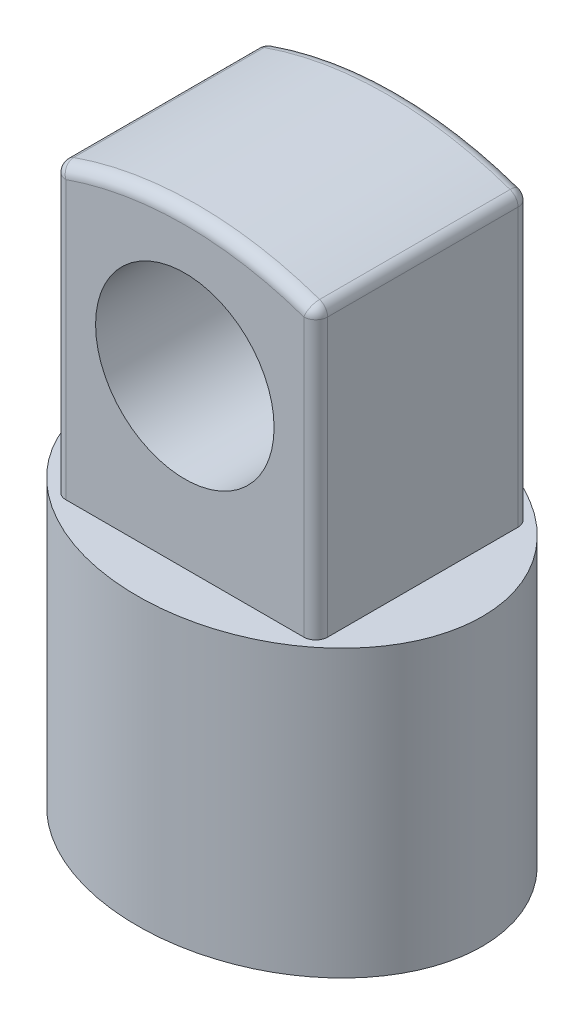
ISO-10303-21;
HEADER;
FILE_DESCRIPTION(('STEP AP214'),'2;1');
FILE_NAME('part.step','',(''),(''),'','','');
FILE_SCHEMA(('AUTOMOTIVE_DESIGN { 1 0 10303 214 1 1 1 1 }'));
ENDSEC;
DATA;
#1=APPLICATION_CONTEXT('core data for automotive mechanical design processes');
#2=APPLICATION_PROTOCOL_DEFINITION('international standard','automotive_design',2000,#1);
#3=PRODUCT_CONTEXT('',#1,'mechanical');
#4=PRODUCT('Part','Part','',(#3));
#5=PRODUCT_RELATED_PRODUCT_CATEGORY('part','',(#4));
#6=PRODUCT_DEFINITION_FORMATION('','',#4);
#7=PRODUCT_DEFINITION_CONTEXT('part definition',#1,'design');
#8=PRODUCT_DEFINITION('design','',#6,#7);
#9=PRODUCT_DEFINITION_SHAPE('','',#8);
#10=(LENGTH_UNIT() NAMED_UNIT(*) SI_UNIT(.MILLI.,.METRE.));
#11=(NAMED_UNIT(*) PLANE_ANGLE_UNIT() SI_UNIT($,.RADIAN.));
#12=(NAMED_UNIT(*) SI_UNIT($,.STERADIAN.) SOLID_ANGLE_UNIT());
#13=UNCERTAINTY_MEASURE_WITH_UNIT(LENGTH_MEASURE(1.E-05),#10,'distance_accuracy_value','');
#14=(GEOMETRIC_REPRESENTATION_CONTEXT(3) GLOBAL_UNCERTAINTY_ASSIGNED_CONTEXT((#13)) GLOBAL_UNIT_ASSIGNED_CONTEXT((#10,
#11,#12)) REPRESENTATION_CONTEXT('',''));
#15=CARTESIAN_POINT('',(0.,0.,0.));
#16=DIRECTION('',(0.,0.,1.));
#17=DIRECTION('',(1.,0.,0.));
#18=AXIS2_PLACEMENT_3D('',#15,#16,#17);
#19=CARTESIAN_POINT('',(0.,0.,0.));
#20=DIRECTION('',(0.,1.,0.));
#21=DIRECTION('',(1.,0.,0.));
#22=AXIS2_PLACEMENT_3D('',#19,#20,#21);
#23=ELLIPSE('',#22,8.,6.5);
#24=DIRECTION('',(0.,1.,0.));
#25=VECTOR('',#24,1.);
#26=SURFACE_OF_LINEAR_EXTRUSION('',#23,#25);
#27=CARTESIAN_POINT('',(8.,0.,0.));
#28=VERTEX_POINT('',#27);
#29=EDGE_CURVE('E225',#28,#28,#23,.T.);
#30=ORIENTED_EDGE('',*,*,#29,.T.);
#31=EDGE_LOOP('',(#30));
#32=FACE_BOUND('',#31,.T.);
#33=CARTESIAN_POINT('',(0.,12.,0.));
#34=DIRECTION('',(0.,1.,0.));
#35=DIRECTION('',(1.,0.,0.));
#36=AXIS2_PLACEMENT_3D('',#33,#34,#35);
#37=ELLIPSE('',#36,8.,6.5);
#38=CARTESIAN_POINT('',(8.,12.,0.));
#39=VERTEX_POINT('',#38);
#40=EDGE_CURVE('E221',#39,#39,#37,.T.);
#41=ORIENTED_EDGE('',*,*,#40,.F.);
#42=EDGE_LOOP('',(#41));
#43=FACE_BOUND('',#42,.T.);
#44=ADVANCED_FACE('F41',(#32,#43),#26,.T.);
#45=CARTESIAN_POINT('',(0.,0.,0.));
#46=DIRECTION('',(0.,1.,0.));
#47=DIRECTION('',(0.,0.,1.));
#48=AXIS2_PLACEMENT_3D('',#45,#46,#47);
#49=PLANE('',#48);
#50=ORIENTED_EDGE('',*,*,#29,.F.);
#51=EDGE_LOOP('',(#50));
#52=FACE_BOUND('',#51,.T.);
#53=ADVANCED_FACE('F235',(#52),#49,.F.);
#54=CARTESIAN_POINT('',(0.,12.,0.));
#55=DIRECTION('',(0.,1.,0.));
#56=DIRECTION('',(0.,0.,1.));
#57=AXIS2_PLACEMENT_3D('',#54,#55,#56);
#58=PLANE('',#57);
#59=DIRECTION('',(1.,0.,0.));
#60=VECTOR('',#59,1.);
#61=CARTESIAN_POINT('',(-5.5,12.,4.5));
#62=LINE('',#61,#60);
#63=CARTESIAN_POINT('',(-5.,12.,4.5));
#64=VERTEX_POINT('',#63);
#65=CARTESIAN_POINT('',(5.,12.,4.5));
#66=VERTEX_POINT('',#65);
#67=EDGE_CURVE('E121',#64,#66,#62,.T.);
#68=ORIENTED_EDGE('',*,*,#67,.F.);
#69=CARTESIAN_POINT('',(-5.,12.,4.));
#70=DIRECTION('',(0.,1.,0.));
#71=DIRECTION('',(0.,0.,1.));
#72=AXIS2_PLACEMENT_3D('',#69,#70,#71);
#73=CIRCLE('',#72,0.5);
#74=CARTESIAN_POINT('',(-5.5,12.,4.));
#75=VERTEX_POINT('',#74);
#76=EDGE_CURVE('E11',#64,#75,#73,.F.);
#77=ORIENTED_EDGE('',*,*,#76,.T.);
#78=DIRECTION('',(0.,0.,1.));
#79=VECTOR('',#78,1.);
#80=CARTESIAN_POINT('',(-5.5,12.,-4.5));
#81=LINE('',#80,#79);
#82=CARTESIAN_POINT('',(-5.5,12.,-4.));
#83=VERTEX_POINT('',#82);
#84=EDGE_CURVE('E216',#83,#75,#81,.T.);
#85=ORIENTED_EDGE('',*,*,#84,.F.);
#86=CARTESIAN_POINT('',(-5.,12.,-4.));
#87=DIRECTION('',(0.,1.,0.));
#88=DIRECTION('',(0.,0.,1.));
#89=AXIS2_PLACEMENT_3D('',#86,#87,#88);
#90=CIRCLE('',#89,0.5);
#91=CARTESIAN_POINT('',(-5.,12.,-4.5));
#92=VERTEX_POINT('',#91);
#93=EDGE_CURVE('E50',#83,#92,#90,.F.);
#94=ORIENTED_EDGE('',*,*,#93,.T.);
#95=DIRECTION('',(1.,0.,0.));
#96=VECTOR('',#95,1.);
#97=CARTESIAN_POINT('',(-5.5,12.,-4.5));
#98=LINE('',#97,#96);
#99=CARTESIAN_POINT('',(5.,12.,-4.5));
#100=VERTEX_POINT('',#99);
#101=EDGE_CURVE('E130',#92,#100,#98,.T.);
#102=ORIENTED_EDGE('',*,*,#101,.T.);
#103=CARTESIAN_POINT('',(5.,12.,-4.));
#104=DIRECTION('',(0.,1.,0.));
#105=DIRECTION('',(0.,0.,1.));
#106=AXIS2_PLACEMENT_3D('',#103,#104,#105);
#107=CIRCLE('',#106,0.5);
#108=CARTESIAN_POINT('',(5.5,12.,-4.));
#109=VERTEX_POINT('',#108);
#110=EDGE_CURVE('E177',#100,#109,#107,.F.);
#111=ORIENTED_EDGE('',*,*,#110,.T.);
#112=DIRECTION('',(0.,0.,1.));
#113=VECTOR('',#112,1.);
#114=CARTESIAN_POINT('',(5.5,12.,-4.5));
#115=LINE('',#114,#113);
#116=CARTESIAN_POINT('',(5.5,12.,4.));
#117=VERTEX_POINT('',#116);
#118=EDGE_CURVE('E138',#109,#117,#115,.T.);
#119=ORIENTED_EDGE('',*,*,#118,.T.);
#120=CARTESIAN_POINT('',(5.,12.,4.));
#121=DIRECTION('',(0.,1.,0.));
#122=DIRECTION('',(0.,0.,1.));
#123=AXIS2_PLACEMENT_3D('',#120,#121,#122);
#124=CIRCLE('',#123,0.5);
#125=EDGE_CURVE('E134',#117,#66,#124,.F.);
#126=ORIENTED_EDGE('',*,*,#125,.T.);
#127=EDGE_LOOP('',(#68,#77,#85,#94,#102,#111,#119,#126));
#128=FACE_BOUND('',#127,.T.);
#129=ORIENTED_EDGE('',*,*,#40,.T.);
#130=EDGE_LOOP('',(#129));
#131=FACE_BOUND('',#130,.T.);
#132=ADVANCED_FACE('F135',(#128,#131),#58,.T.);
#133=CARTESIAN_POINT('',(0.,9.375,-4.5));
#134=DIRECTION('',(0.,0.,1.));
#135=DIRECTION('',(1.,0.,0.));
#136=AXIS2_PLACEMENT_3D('',#133,#134,#135);
#137=CYLINDRICAL_SURFACE('',#136,15.625);
#138=CARTESIAN_POINT('',(0.,9.375,-4.));
#139=DIRECTION('',(0.,0.,1.));
#140=DIRECTION('',(1.,0.,0.));
#141=AXIS2_PLACEMENT_3D('',#138,#139,#140);
#142=CIRCLE('',#141,15.625);
#143=CARTESIAN_POINT('',(5.16528925619835,24.1215389803778,-4.));
#144=VERTEX_POINT('',#143);
#145=CARTESIAN_POINT('',(-5.16528925619835,24.1215389803778,-4.));
#146=VERTEX_POINT('',#145);
#147=EDGE_CURVE('E175',#144,#146,#142,.T.);
#148=ORIENTED_EDGE('',*,*,#147,.T.);
#149=DIRECTION('',(0.,0.,1.));
#150=VECTOR('',#149,1.);
#151=CARTESIAN_POINT('',(-5.16528925619835,24.1215389803778,-4.5));
#152=LINE('',#151,#150);
#153=CARTESIAN_POINT('',(-5.16528925619835,24.1215389803778,4.));
#154=VERTEX_POINT('',#153);
#155=EDGE_CURVE('E58',#146,#154,#152,.T.);
#156=ORIENTED_EDGE('',*,*,#155,.T.);
#157=CARTESIAN_POINT('',(0.,9.375,4.));
#158=DIRECTION('',(0.,0.,1.));
#159=DIRECTION('',(1.,0.,0.));
#160=AXIS2_PLACEMENT_3D('',#157,#158,#159);
#161=CIRCLE('',#160,15.625);
#162=CARTESIAN_POINT('',(5.16528925619835,24.1215389803778,4.));
#163=VERTEX_POINT('',#162);
#164=EDGE_CURVE('E143',#154,#163,#161,.F.);
#165=ORIENTED_EDGE('',*,*,#164,.T.);
#166=DIRECTION('',(0.,0.,1.));
#167=VECTOR('',#166,1.);
#168=CARTESIAN_POINT('',(5.16528925619835,24.1215389803778,-4.5));
#169=LINE('',#168,#167);
#170=EDGE_CURVE('E154',#163,#144,#169,.F.);
#171=ORIENTED_EDGE('',*,*,#170,.T.);
#172=EDGE_LOOP('',(#148,#156,#165,#171));
#173=FACE_BOUND('',#172,.T.);
#174=ADVANCED_FACE('F326',(#173),#137,.T.);
#175=CARTESIAN_POINT('',(5.5,12.,-4.5));
#176=DIRECTION('',(1.,0.,0.));
#177=DIRECTION('',(0.,0.,-1.));
#178=AXIS2_PLACEMENT_3D('',#175,#176,#177);
#179=PLANE('',#178);
#180=ORIENTED_EDGE('',*,*,#118,.F.);
#181=DIRECTION('',(0.,1.,0.));
#182=VECTOR('',#181,1.);
#183=CARTESIAN_POINT('',(5.5,23.6496497330057,-4.));
#184=LINE('',#183,#182);
#185=CARTESIAN_POINT('',(5.5,23.6496497330057,-4.));
#186=VERTEX_POINT('',#185);
#187=EDGE_CURVE('E142',#109,#186,#184,.T.);
#188=ORIENTED_EDGE('',*,*,#187,.T.);
#189=DIRECTION('',(0.,0.,1.));
#190=VECTOR('',#189,1.);
#191=CARTESIAN_POINT('',(5.5,23.6496497330057,-4.5));
#192=LINE('',#191,#190);
#193=CARTESIAN_POINT('',(5.5,23.6496497330057,4.));
#194=VERTEX_POINT('',#193);
#195=EDGE_CURVE('E229',#186,#194,#192,.T.);
#196=ORIENTED_EDGE('',*,*,#195,.T.);
#197=DIRECTION('',(0.,1.,0.));
#198=VECTOR('',#197,1.);
#199=CARTESIAN_POINT('',(5.5,12.,4.));
#200=LINE('',#199,#198);
#201=EDGE_CURVE('E149',#194,#117,#200,.F.);
#202=ORIENTED_EDGE('',*,*,#201,.T.);
#203=EDGE_LOOP('',(#180,#188,#196,#202));
#204=FACE_BOUND('',#203,.T.);
#205=ADVANCED_FACE('F320',(#204),#179,.T.);
#206=CARTESIAN_POINT('',(-5.5,24.,-4.5));
#207=DIRECTION('',(-1.,0.,0.));
#208=DIRECTION('',(0.,0.,1.));
#209=AXIS2_PLACEMENT_3D('',#206,#207,#208);
#210=PLANE('',#209);
#211=DIRECTION('',(0.,0.,1.));
#212=VECTOR('',#211,1.);
#213=CARTESIAN_POINT('',(-5.5,23.6496497330057,-4.5));
#214=LINE('',#213,#212);
#215=CARTESIAN_POINT('',(-5.5,23.6496497330057,4.));
#216=VERTEX_POINT('',#215);
#217=CARTESIAN_POINT('',(-5.5,23.6496497330057,-4.));
#218=VERTEX_POINT('',#217);
#219=EDGE_CURVE('E179',#216,#218,#214,.F.);
#220=ORIENTED_EDGE('',*,*,#219,.T.);
#221=DIRECTION('',(0.,-1.,0.));
#222=VECTOR('',#221,1.);
#223=CARTESIAN_POINT('',(-5.5,12.,-4.));
#224=LINE('',#223,#222);
#225=EDGE_CURVE('E187',#218,#83,#224,.T.);
#226=ORIENTED_EDGE('',*,*,#225,.T.);
#227=ORIENTED_EDGE('',*,*,#84,.T.);
#228=DIRECTION('',(0.,-1.,0.));
#229=VECTOR('',#228,1.);
#230=CARTESIAN_POINT('',(-5.5,24.,4.));
#231=LINE('',#230,#229);
#232=EDGE_CURVE('E185',#75,#216,#231,.F.);
#233=ORIENTED_EDGE('',*,*,#232,.T.);
#234=EDGE_LOOP('',(#220,#226,#227,#233));
#235=FACE_BOUND('',#234,.T.);
#236=ADVANCED_FACE('F218',(#235),#210,.T.);
#237=CARTESIAN_POINT('',(0.,9.375,-4.5));
#238=DIRECTION('',(0.,0.,1.));
#239=DIRECTION('',(1.,0.,0.));
#240=AXIS2_PLACEMENT_3D('',#237,#238,#239);
#241=PLANE('',#240);
#242=CARTESIAN_POINT('',(0.,19.,-4.5));
#243=DIRECTION('',(0.,0.,-1.));
#244=DIRECTION('',(-1.,0.,0.));
#245=AXIS2_PLACEMENT_3D('',#242,#243,#244);
#246=CIRCLE('',#245,3.74999999999999);
#247=CARTESIAN_POINT('',(-3.74999999999999,19.,-4.5));
#248=VERTEX_POINT('',#247);
#249=EDGE_CURVE('E165',#248,#248,#246,.T.);
#250=ORIENTED_EDGE('',*,*,#249,.F.);
#251=EDGE_LOOP('',(#250));
#252=FACE_BOUND('',#251,.T.);
#253=ORIENTED_EDGE('',*,*,#101,.F.);
#254=DIRECTION('',(0.,-1.,0.));
#255=VECTOR('',#254,1.);
#256=CARTESIAN_POINT('',(-5.,23.4645573031944,-4.5));
#257=LINE('',#256,#255);
#258=CARTESIAN_POINT('',(-5.,23.6496497330057,-4.5));
#259=VERTEX_POINT('',#258);
#260=EDGE_CURVE('E190',#92,#259,#257,.F.);
#261=ORIENTED_EDGE('',*,*,#260,.T.);
#262=CARTESIAN_POINT('',(0.,9.375,-4.5));
#263=DIRECTION('',(0.,0.,1.));
#264=DIRECTION('',(1.,0.,0.));
#265=AXIS2_PLACEMENT_3D('',#262,#263,#264);
#266=CIRCLE('',#265,15.125);
#267=CARTESIAN_POINT('',(5.,23.6496497330057,-4.5));
#268=VERTEX_POINT('',#267);
#269=EDGE_CURVE('E168',#259,#268,#266,.F.);
#270=ORIENTED_EDGE('',*,*,#269,.T.);
#271=DIRECTION('',(0.,1.,0.));
#272=VECTOR('',#271,1.);
#273=CARTESIAN_POINT('',(5.,12.,-4.5));
#274=LINE('',#273,#272);
#275=EDGE_CURVE('E170',#268,#100,#274,.F.);
#276=ORIENTED_EDGE('',*,*,#275,.T.);
#277=EDGE_LOOP('',(#253,#261,#270,#276));
#278=FACE_BOUND('',#277,.T.);
#279=ADVANCED_FACE('F302',(#252,#278),#241,.F.);
#280=CARTESIAN_POINT('',(0.,9.375,4.5));
#281=DIRECTION('',(0.,0.,1.));
#282=DIRECTION('',(1.,0.,0.));
#283=AXIS2_PLACEMENT_3D('',#280,#281,#282);
#284=PLANE('',#283);
#285=CARTESIAN_POINT('',(0.,19.,4.5));
#286=DIRECTION('',(0.,0.,1.));
#287=DIRECTION('',(1.,0.,0.));
#288=AXIS2_PLACEMENT_3D('',#285,#286,#287);
#289=CIRCLE('',#288,3.74999999999999);
#290=CARTESIAN_POINT('',(3.74999999999998,19.,4.5));
#291=VERTEX_POINT('',#290);
#292=EDGE_CURVE('E131',#291,#291,#289,.T.);
#293=ORIENTED_EDGE('',*,*,#292,.F.);
#294=EDGE_LOOP('',(#293));
#295=FACE_BOUND('',#294,.T.);
#296=CARTESIAN_POINT('',(0.,9.375,4.5));
#297=DIRECTION('',(0.,0.,1.));
#298=DIRECTION('',(1.,0.,0.));
#299=AXIS2_PLACEMENT_3D('',#296,#297,#298);
#300=CIRCLE('',#299,15.125);
#301=CARTESIAN_POINT('',(5.,23.6496497330057,4.5));
#302=VERTEX_POINT('',#301);
#303=CARTESIAN_POINT('',(-5.,23.6496497330057,4.5));
#304=VERTEX_POINT('',#303);
#305=EDGE_CURVE('E150',#302,#304,#300,.T.);
#306=ORIENTED_EDGE('',*,*,#305,.T.);
#307=DIRECTION('',(0.,-1.,0.));
#308=VECTOR('',#307,1.);
#309=CARTESIAN_POINT('',(-5.,9.375,4.5));
#310=LINE('',#309,#308);
#311=EDGE_CURVE('E127',#304,#64,#310,.T.);
#312=ORIENTED_EDGE('',*,*,#311,.T.);
#313=ORIENTED_EDGE('',*,*,#67,.T.);
#314=DIRECTION('',(0.,1.,0.));
#315=VECTOR('',#314,1.);
#316=CARTESIAN_POINT('',(5.,9.375,4.5));
#317=LINE('',#316,#315);
#318=EDGE_CURVE('E125',#66,#302,#317,.T.);
#319=ORIENTED_EDGE('',*,*,#318,.T.);
#320=EDGE_LOOP('',(#306,#312,#313,#319));
#321=FACE_BOUND('',#320,.T.);
#322=ADVANCED_FACE('F123',(#295,#321),#284,.T.);
#323=CARTESIAN_POINT('',(0.,19.,-4.5));
#324=DIRECTION('',(0.,0.,-1.));
#325=DIRECTION('',(-1.,0.,0.));
#326=AXIS2_PLACEMENT_3D('',#323,#324,#325);
#327=CYLINDRICAL_SURFACE('',#326,3.74999999999999);
#328=ORIENTED_EDGE('',*,*,#292,.T.);
#329=EDGE_LOOP('',(#328));
#330=FACE_BOUND('',#329,.T.);
#331=ORIENTED_EDGE('',*,*,#249,.T.);
#332=EDGE_LOOP('',(#331));
#333=FACE_BOUND('',#332,.T.);
#334=ADVANCED_FACE('F242',(#330,#333),#327,.F.);
#335=CARTESIAN_POINT('',(5.,23.6496497330057,-4.5));
#336=DIRECTION('',(0.,0.,1.));
#337=DIRECTION('',(1.,0.,0.));
#338=AXIS2_PLACEMENT_3D('',#335,#336,#337);
#339=CYLINDRICAL_SURFACE('',#338,0.5);
#340=ORIENTED_EDGE('',*,*,#195,.F.);
#341=CARTESIAN_POINT('',(5.,23.6496497330057,-4.));
#342=DIRECTION('',(0.,0.,1.));
#343=DIRECTION('',(1.,0.,0.));
#344=AXIS2_PLACEMENT_3D('',#341,#342,#343);
#345=CIRCLE('',#344,0.5);
#346=EDGE_CURVE('E173',#186,#144,#345,.T.);
#347=ORIENTED_EDGE('',*,*,#346,.T.);
#348=ORIENTED_EDGE('',*,*,#170,.F.);
#349=CARTESIAN_POINT('',(5.,23.6496497330057,4.));
#350=DIRECTION('',(0.,0.,1.));
#351=DIRECTION('',(1.,0.,0.));
#352=AXIS2_PLACEMENT_3D('',#349,#350,#351);
#353=CIRCLE('',#352,0.5);
#354=EDGE_CURVE('E152',#163,#194,#353,.F.);
#355=ORIENTED_EDGE('',*,*,#354,.T.);
#356=EDGE_LOOP('',(#340,#347,#348,#355));
#357=FACE_BOUND('',#356,.T.);
#358=ADVANCED_FACE('F238',(#357),#339,.T.);
#359=CARTESIAN_POINT('',(0.,9.375,4.));
#360=DIRECTION('',(0.,0.,1.));
#361=DIRECTION('',(1.,0.,0.));
#362=AXIS2_PLACEMENT_3D('',#359,#360,#361);
#363=TOROIDAL_SURFACE('',#362,15.125,0.5);
#364=ORIENTED_EDGE('',*,*,#164,.F.);
#365=CARTESIAN_POINT('',(-5.,23.6496497330057,4.));
#366=DIRECTION('',(-0.943778494744179,-0.330578512396694,0.));
#367=DIRECTION('',(0.330578512396694,-0.943778494744179,0.));
#368=AXIS2_PLACEMENT_3D('',#365,#366,#367);
#369=CIRCLE('',#368,0.5);
#370=EDGE_CURVE('E65',#154,#304,#369,.F.);
#371=ORIENTED_EDGE('',*,*,#370,.T.);
#372=ORIENTED_EDGE('',*,*,#305,.F.);
#373=CARTESIAN_POINT('',(5.,23.6496497330057,4.));
#374=DIRECTION('',(0.94377849474418,-0.330578512396693,0.));
#375=DIRECTION('',(0.330578512396693,0.94377849474418,0.));
#376=AXIS2_PLACEMENT_3D('',#373,#374,#375);
#377=CIRCLE('',#376,0.5);
#378=EDGE_CURVE('E162',#163,#302,#377,.T.);
#379=ORIENTED_EDGE('',*,*,#378,.F.);
#380=EDGE_LOOP('',(#364,#371,#372,#379));
#381=FACE_BOUND('',#380,.T.);
#382=ADVANCED_FACE('F241',(#381),#363,.T.);
#383=CARTESIAN_POINT('',(5.,23.6496497330057,4.));
#384=DIRECTION('',(0.,0.,1.));
#385=DIRECTION('',(1.,0.,0.));
#386=AXIS2_PLACEMENT_3D('',#383,#384,#385);
#387=SPHERICAL_SURFACE('',#386,0.5);
#388=ORIENTED_EDGE('',*,*,#354,.F.);
#389=ORIENTED_EDGE('',*,*,#378,.T.);
#390=CARTESIAN_POINT('',(5.,23.6496497330057,4.));
#391=DIRECTION('',(0.,-1.,0.));
#392=DIRECTION('',(0.,0.,-1.));
#393=AXIS2_PLACEMENT_3D('',#390,#391,#392);
#394=CIRCLE('',#393,0.5);
#395=EDGE_CURVE('E147',#194,#302,#394,.T.);
#396=ORIENTED_EDGE('',*,*,#395,.F.);
#397=EDGE_LOOP('',(#388,#389,#396));
#398=FACE_BOUND('',#397,.T.);
#399=ADVANCED_FACE('F247',(#398),#387,.T.);
#400=CARTESIAN_POINT('',(5.,9.375,4.));
#401=DIRECTION('',(0.,1.,0.));
#402=DIRECTION('',(0.,0.,1.));
#403=AXIS2_PLACEMENT_3D('',#400,#401,#402);
#404=CYLINDRICAL_SURFACE('',#403,0.5);
#405=ORIENTED_EDGE('',*,*,#125,.F.);
#406=ORIENTED_EDGE('',*,*,#201,.F.);
#407=ORIENTED_EDGE('',*,*,#395,.T.);
#408=ORIENTED_EDGE('',*,*,#318,.F.);
#409=EDGE_LOOP('',(#405,#406,#407,#408));
#410=FACE_BOUND('',#409,.T.);
#411=ADVANCED_FACE('F145',(#410),#404,.T.);
#412=CARTESIAN_POINT('',(0.,9.375,-4.));
#413=DIRECTION('',(0.,0.,1.));
#414=DIRECTION('',(1.,0.,0.));
#415=AXIS2_PLACEMENT_3D('',#412,#413,#414);
#416=TOROIDAL_SURFACE('',#415,15.125,0.5);
#417=ORIENTED_EDGE('',*,*,#269,.F.);
#418=CARTESIAN_POINT('',(-5.,23.6496497330057,-4.));
#419=DIRECTION('',(-0.943778494744179,-0.330578512396694,0.));
#420=DIRECTION('',(0.330578512396694,-0.943778494744179,0.));
#421=AXIS2_PLACEMENT_3D('',#418,#419,#420);
#422=CIRCLE('',#421,0.5);
#423=EDGE_CURVE('E192',#259,#146,#422,.F.);
#424=ORIENTED_EDGE('',*,*,#423,.T.);
#425=ORIENTED_EDGE('',*,*,#147,.F.);
#426=CARTESIAN_POINT('',(5.,23.6496497330057,-4.));
#427=DIRECTION('',(0.943778494744179,-0.330578512396693,0.));
#428=DIRECTION('',(0.330578512396693,0.94377849474418,0.));
#429=AXIS2_PLACEMENT_3D('',#426,#427,#428);
#430=CIRCLE('',#429,0.5);
#431=EDGE_CURVE('E163',#268,#144,#430,.T.);
#432=ORIENTED_EDGE('',*,*,#431,.F.);
#433=EDGE_LOOP('',(#417,#424,#425,#432));
#434=FACE_BOUND('',#433,.T.);
#435=ADVANCED_FACE('F246',(#434),#416,.T.);
#436=CARTESIAN_POINT('',(5.,23.6496497330057,-4.));
#437=DIRECTION('',(0.,0.,1.));
#438=DIRECTION('',(1.,0.,0.));
#439=AXIS2_PLACEMENT_3D('',#436,#437,#438);
#440=SPHERICAL_SURFACE('',#439,0.5);
#441=ORIENTED_EDGE('',*,*,#431,.T.);
#442=ORIENTED_EDGE('',*,*,#346,.F.);
#443=CARTESIAN_POINT('',(5.,23.6496497330057,-4.));
#444=DIRECTION('',(0.,-1.,0.));
#445=DIRECTION('',(0.,0.,-1.));
#446=AXIS2_PLACEMENT_3D('',#443,#444,#445);
#447=CIRCLE('',#446,0.5);
#448=EDGE_CURVE('E180',#268,#186,#447,.T.);
#449=ORIENTED_EDGE('',*,*,#448,.F.);
#450=EDGE_LOOP('',(#441,#442,#449));
#451=FACE_BOUND('',#450,.T.);
#452=ADVANCED_FACE('F256',(#451),#440,.T.);
#453=CARTESIAN_POINT('',(5.,12.,-4.));
#454=DIRECTION('',(0.,-1.,0.));
#455=DIRECTION('',(0.,0.,-1.));
#456=AXIS2_PLACEMENT_3D('',#453,#454,#455);
#457=CYLINDRICAL_SURFACE('',#456,0.5);
#458=ORIENTED_EDGE('',*,*,#110,.F.);
#459=ORIENTED_EDGE('',*,*,#275,.F.);
#460=ORIENTED_EDGE('',*,*,#448,.T.);
#461=ORIENTED_EDGE('',*,*,#187,.F.);
#462=EDGE_LOOP('',(#458,#459,#460,#461));
#463=FACE_BOUND('',#462,.T.);
#464=ADVANCED_FACE('F253',(#463),#457,.T.);
#465=CARTESIAN_POINT('',(-5.,9.375,4.));
#466=DIRECTION('',(0.,-1.,0.));
#467=DIRECTION('',(0.,0.,-1.));
#468=AXIS2_PLACEMENT_3D('',#465,#466,#467);
#469=CYLINDRICAL_SURFACE('',#468,0.5);
#470=ORIENTED_EDGE('',*,*,#76,.F.);
#471=ORIENTED_EDGE('',*,*,#311,.F.);
#472=CARTESIAN_POINT('',(-5.,23.6496497330057,4.));
#473=DIRECTION('',(0.,1.,0.));
#474=DIRECTION('',(0.,0.,1.));
#475=AXIS2_PLACEMENT_3D('',#472,#473,#474);
#476=CIRCLE('',#475,0.5);
#477=EDGE_CURVE('E45',#216,#304,#476,.T.);
#478=ORIENTED_EDGE('',*,*,#477,.F.);
#479=ORIENTED_EDGE('',*,*,#232,.F.);
#480=EDGE_LOOP('',(#470,#471,#478,#479));
#481=FACE_BOUND('',#480,.T.);
#482=ADVANCED_FACE('F43',(#481),#469,.T.);
#483=CARTESIAN_POINT('',(-5.,23.6496497330057,4.));
#484=DIRECTION('',(-1.,0.,0.));
#485=DIRECTION('',(0.,0.,1.));
#486=AXIS2_PLACEMENT_3D('',#483,#484,#485);
#487=SPHERICAL_SURFACE('',#486,0.5);
#488=ORIENTED_EDGE('',*,*,#477,.T.);
#489=ORIENTED_EDGE('',*,*,#370,.F.);
#490=CARTESIAN_POINT('',(-5.,23.6496497330057,4.));
#491=DIRECTION('',(0.,0.,-1.));
#492=DIRECTION('',(-1.,0.,0.));
#493=AXIS2_PLACEMENT_3D('',#490,#491,#492);
#494=CIRCLE('',#493,0.5);
#495=EDGE_CURVE('E203',#216,#154,#494,.T.);
#496=ORIENTED_EDGE('',*,*,#495,.F.);
#497=EDGE_LOOP('',(#488,#489,#496));
#498=FACE_BOUND('',#497,.T.);
#499=ADVANCED_FACE('F211',(#498),#487,.T.);
#500=CARTESIAN_POINT('',(-5.,23.6496497330057,-4.5));
#501=DIRECTION('',(0.,0.,1.));
#502=DIRECTION('',(1.,0.,0.));
#503=AXIS2_PLACEMENT_3D('',#500,#501,#502);
#504=CYLINDRICAL_SURFACE('',#503,0.5);
#505=ORIENTED_EDGE('',*,*,#495,.T.);
#506=ORIENTED_EDGE('',*,*,#155,.F.);
#507=CARTESIAN_POINT('',(-5.,23.6496497330057,-4.));
#508=DIRECTION('',(0.,0.,-1.));
#509=DIRECTION('',(-1.,0.,0.));
#510=AXIS2_PLACEMENT_3D('',#507,#508,#509);
#511=CIRCLE('',#510,0.5);
#512=EDGE_CURVE('E201',#218,#146,#511,.T.);
#513=ORIENTED_EDGE('',*,*,#512,.F.);
#514=ORIENTED_EDGE('',*,*,#219,.F.);
#515=EDGE_LOOP('',(#505,#506,#513,#514));
#516=FACE_BOUND('',#515,.T.);
#517=ADVANCED_FACE('F271',(#516),#504,.T.);
#518=CARTESIAN_POINT('',(-5.,23.6496497330057,-4.));
#519=DIRECTION('',(-1.,0.,0.));
#520=DIRECTION('',(0.,0.,1.));
#521=AXIS2_PLACEMENT_3D('',#518,#519,#520);
#522=SPHERICAL_SURFACE('',#521,0.5);
#523=ORIENTED_EDGE('',*,*,#512,.T.);
#524=ORIENTED_EDGE('',*,*,#423,.F.);
#525=CARTESIAN_POINT('',(-5.,23.6496497330057,-4.));
#526=DIRECTION('',(0.,-1.,0.));
#527=DIRECTION('',(0.,0.,-1.));
#528=AXIS2_PLACEMENT_3D('',#525,#526,#527);
#529=CIRCLE('',#528,0.5);
#530=EDGE_CURVE('E198',#218,#259,#529,.T.);
#531=ORIENTED_EDGE('',*,*,#530,.F.);
#532=EDGE_LOOP('',(#523,#524,#531));
#533=FACE_BOUND('',#532,.T.);
#534=ADVANCED_FACE('F267',(#533),#522,.T.);
#535=CARTESIAN_POINT('',(-5.,24.,-4.));
#536=DIRECTION('',(0.,1.,0.));
#537=DIRECTION('',(0.,0.,1.));
#538=AXIS2_PLACEMENT_3D('',#535,#536,#537);
#539=CYLINDRICAL_SURFACE('',#538,0.5);
#540=ORIENTED_EDGE('',*,*,#530,.T.);
#541=ORIENTED_EDGE('',*,*,#260,.F.);
#542=ORIENTED_EDGE('',*,*,#93,.F.);
#543=ORIENTED_EDGE('',*,*,#225,.F.);
#544=EDGE_LOOP('',(#540,#541,#542,#543));
#545=FACE_BOUND('',#544,.T.);
#546=ADVANCED_FACE('F264',(#545),#539,.T.);
#547=CLOSED_SHELL('',(#44,#53,#132,#174,#205,#236,#279,#322,#334,#358,#382,#399,#411,#435,#452,
#464,#482,#499,#517,#534,#546));
#548=MANIFOLD_SOLID_BREP('B2',#547);
#549=ADVANCED_BREP_SHAPE_REPRESENTATION('',(#18,#548),#14);
#550=SHAPE_DEFINITION_REPRESENTATION(#9,#549);
ENDSEC;
END-ISO-10303-21;
